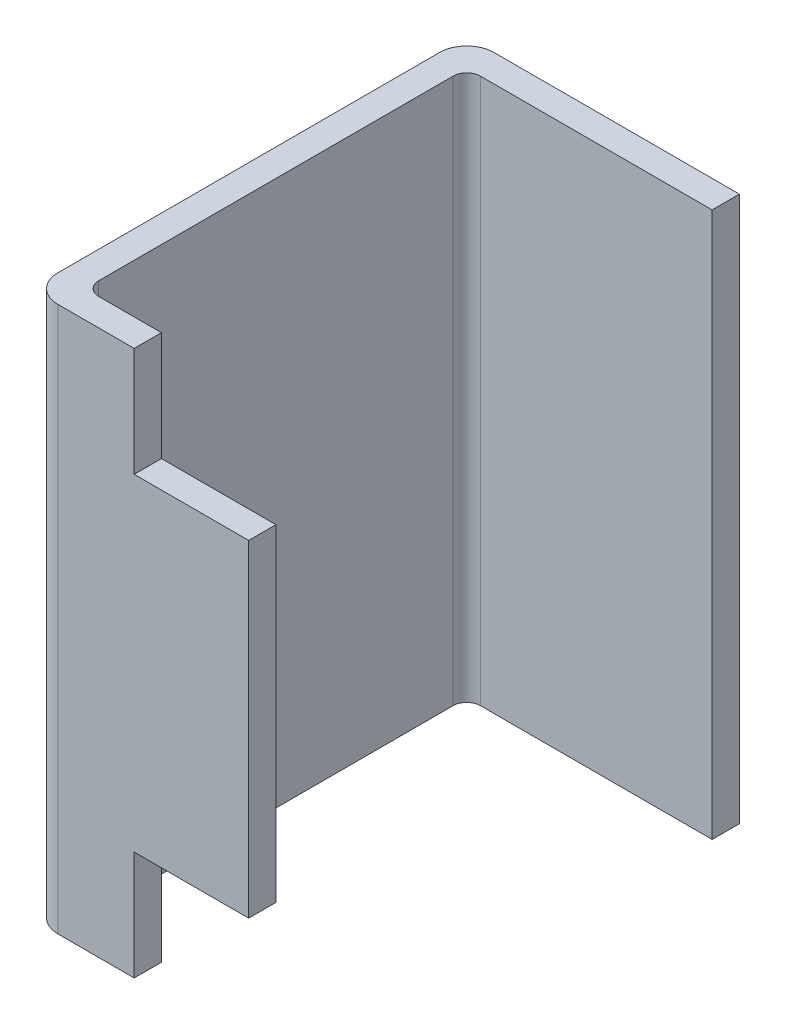
ISO-10303-21;
HEADER;
FILE_DESCRIPTION(('STEP AP214'),'2;1');
FILE_NAME('part.step','',(''),(''),'','','');
FILE_SCHEMA(('AUTOMOTIVE_DESIGN { 1 0 10303 214 1 1 1 1 }'));
ENDSEC;
DATA;
#1=APPLICATION_CONTEXT('core data for automotive mechanical design processes');
#2=APPLICATION_PROTOCOL_DEFINITION('international standard','automotive_design',2000,#1);
#3=PRODUCT_CONTEXT('',#1,'mechanical');
#4=PRODUCT('Part','Part','',(#3));
#5=PRODUCT_RELATED_PRODUCT_CATEGORY('part','',(#4));
#6=PRODUCT_DEFINITION_FORMATION('','',#4);
#7=PRODUCT_DEFINITION_CONTEXT('part definition',#1,'design');
#8=PRODUCT_DEFINITION('design','',#6,#7);
#9=PRODUCT_DEFINITION_SHAPE('','',#8);
#10=(LENGTH_UNIT() NAMED_UNIT(*) SI_UNIT(.MILLI.,.METRE.));
#11=(NAMED_UNIT(*) PLANE_ANGLE_UNIT() SI_UNIT($,.RADIAN.));
#12=(NAMED_UNIT(*) SI_UNIT($,.STERADIAN.) SOLID_ANGLE_UNIT());
#13=UNCERTAINTY_MEASURE_WITH_UNIT(LENGTH_MEASURE(1.E-05),#10,'distance_accuracy_value','');
#14=(GEOMETRIC_REPRESENTATION_CONTEXT(3) GLOBAL_UNCERTAINTY_ASSIGNED_CONTEXT((#13)) GLOBAL_UNIT_ASSIGNED_CONTEXT((#10,
#11,#12)) REPRESENTATION_CONTEXT('',''));
#15=CARTESIAN_POINT('',(0.,0.,0.));
#16=DIRECTION('',(0.,0.,1.));
#17=DIRECTION('',(1.,0.,0.));
#18=AXIS2_PLACEMENT_3D('',#15,#16,#17);
#19=CARTESIAN_POINT('',(0.404981821047639,-0.15,0.4));
#20=DIRECTION('',(0.,-1.,0.));
#21=DIRECTION('',(-1.,0.,0.));
#22=AXIS2_PLACEMENT_3D('',#19,#20,#21);
#23=PLANE('',#22);
#24=DIRECTION('',(0.,0.,-1.));
#25=VECTOR('',#24,1.);
#26=CARTESIAN_POINT('',(-0.3,-0.15,0.4));
#27=LINE('',#26,#25);
#28=CARTESIAN_POINT('',(-0.3,-0.15,0.4));
#29=VERTEX_POINT('',#28);
#30=CARTESIAN_POINT('',(-0.3,-0.15,0.375000000029104));
#31=VERTEX_POINT('',#30);
#32=EDGE_CURVE('E11',#29,#31,#27,.T.);
#33=ORIENTED_EDGE('',*,*,#32,.F.);
#34=DIRECTION('',(1.,0.,0.));
#35=VECTOR('',#34,1.);
#36=CARTESIAN_POINT('',(-0.0350090894761804,-0.15,0.4));
#37=LINE('',#36,#35);
#38=CARTESIAN_POINT('',(-0.404981821047639,-0.15,0.4));
#39=VERTEX_POINT('',#38);
#40=EDGE_CURVE('E24',#39,#29,#37,.T.);
#41=ORIENTED_EDGE('',*,*,#40,.F.);
#42=DIRECTION('',(0.,0.,-1.));
#43=VECTOR('',#42,1.);
#44=CARTESIAN_POINT('',(-0.404981821047639,-0.15,0.4));
#45=LINE('',#44,#43);
#46=CARTESIAN_POINT('',(-0.404981821047639,-0.15,0.375));
#47=VERTEX_POINT('',#46);
#48=EDGE_CURVE('E255',#39,#47,#45,.T.);
#49=ORIENTED_EDGE('',*,*,#48,.T.);
#50=DIRECTION('',(-1.,0.,0.));
#51=VECTOR('',#50,1.);
#52=CARTESIAN_POINT('',(0.0524909105238196,-0.15,0.375000000029103));
#53=LINE('',#52,#51);
#54=EDGE_CURVE('E252',#31,#47,#53,.T.);
#55=ORIENTED_EDGE('',*,*,#54,.F.);
#56=EDGE_LOOP('',(#33,#41,#49,#55));
#57=FACE_BOUND('',#56,.T.);
#58=ADVANCED_FACE('F17',(#57),#23,.T.);
#59=CARTESIAN_POINT('',(-0.404981821047639,-0.15,0.4));
#60=DIRECTION('',(1.,0.,0.));
#61=DIRECTION('',(0.,-1.,0.));
#62=AXIS2_PLACEMENT_3D('',#59,#60,#61);
#63=PLANE('',#62);
#64=DIRECTION('',(0.,0.,1.));
#65=VECTOR('',#64,1.);
#66=CARTESIAN_POINT('',(-0.404981821047639,-0.25,0.3));
#67=LINE('',#66,#65);
#68=CARTESIAN_POINT('',(-0.404981821047639,-0.25,0.375000000029104));
#69=VERTEX_POINT('',#68);
#70=CARTESIAN_POINT('',(-0.404981821047639,-0.25,0.4));
#71=VERTEX_POINT('',#70);
#72=EDGE_CURVE('E250',#69,#71,#67,.T.);
#73=ORIENTED_EDGE('',*,*,#72,.F.);
#74=DIRECTION('',(0.,-1.,0.));
#75=VECTOR('',#74,1.);
#76=CARTESIAN_POINT('',(-0.404981821047639,-0.075,0.375000000029104));
#77=LINE('',#76,#75);
#78=EDGE_CURVE('E247',#47,#69,#77,.T.);
#79=ORIENTED_EDGE('',*,*,#78,.F.);
#80=ORIENTED_EDGE('',*,*,#48,.F.);
#81=DIRECTION('',(0.,1.,0.));
#82=VECTOR('',#81,1.);
#83=CARTESIAN_POINT('',(-0.404981821047639,-0.075,0.4));
#84=LINE('',#83,#82);
#85=EDGE_CURVE('E244',#71,#39,#84,.T.);
#86=ORIENTED_EDGE('',*,*,#85,.F.);
#87=EDGE_LOOP('',(#73,#79,#80,#86));
#88=FACE_BOUND('',#87,.T.);
#89=ADVANCED_FACE('F275',(#88),#63,.T.);
#90=CARTESIAN_POINT('',(-0.3,0.,0.4));
#91=DIRECTION('',(1.,0.,0.));
#92=DIRECTION('',(0.,0.,-1.));
#93=AXIS2_PLACEMENT_3D('',#90,#91,#92);
#94=PLANE('',#93);
#95=ORIENTED_EDGE('',*,*,#32,.T.);
#96=DIRECTION('',(0.,1.,0.));
#97=VECTOR('',#96,1.);
#98=CARTESIAN_POINT('',(-0.3,0.,0.375000000029104));
#99=LINE('',#98,#97);
#100=CARTESIAN_POINT('',(-0.3,0.15,0.375000000029104));
#101=VERTEX_POINT('',#100);
#102=EDGE_CURVE('E242',#31,#101,#99,.T.);
#103=ORIENTED_EDGE('',*,*,#102,.T.);
#104=DIRECTION('',(0.,0.,1.));
#105=VECTOR('',#104,1.);
#106=CARTESIAN_POINT('',(-0.3,0.15,0.4));
#107=LINE('',#106,#105);
#108=CARTESIAN_POINT('',(-0.3,0.15,0.4));
#109=VERTEX_POINT('',#108);
#110=EDGE_CURVE('E240',#101,#109,#107,.T.);
#111=ORIENTED_EDGE('',*,*,#110,.T.);
#112=DIRECTION('',(0.,1.,0.));
#113=VECTOR('',#112,1.);
#114=CARTESIAN_POINT('',(-0.3,0.,0.4));
#115=LINE('',#114,#113);
#116=EDGE_CURVE('E131',#29,#109,#115,.T.);
#117=ORIENTED_EDGE('',*,*,#116,.F.);
#118=EDGE_LOOP('',(#95,#103,#111,#117));
#119=FACE_BOUND('',#118,.T.);
#120=ADVANCED_FACE('F259',(#119),#94,.T.);
#121=CARTESIAN_POINT('',(-0.3,0.,0.375000000029104));
#122=DIRECTION('',(0.,0.,-1.));
#123=DIRECTION('',(-1.,0.,0.));
#124=AXIS2_PLACEMENT_3D('',#121,#122,#123);
#125=PLANE('',#124);
#126=ORIENTED_EDGE('',*,*,#54,.T.);
#127=ORIENTED_EDGE('',*,*,#78,.T.);
#128=DIRECTION('',(1.,0.,0.));
#129=VECTOR('',#128,1.);
#130=CARTESIAN_POINT('',(-0.3,-0.25,0.375000000029104));
#131=LINE('',#130,#129);
#132=CARTESIAN_POINT('',(-0.46250000000291,-0.25,0.375000000029104));
#133=VERTEX_POINT('',#132);
#134=EDGE_CURVE('E236',#133,#69,#131,.T.);
#135=ORIENTED_EDGE('',*,*,#134,.F.);
#136=DIRECTION('',(0.,1.,0.));
#137=VECTOR('',#136,1.);
#138=CARTESIAN_POINT('',(-0.46250000000291,0.,0.375000000029104));
#139=LINE('',#138,#137);
#140=CARTESIAN_POINT('',(-0.46250000000291,0.25,0.375000000029104));
#141=VERTEX_POINT('',#140);
#142=EDGE_CURVE('E234',#133,#141,#139,.T.);
#143=ORIENTED_EDGE('',*,*,#142,.T.);
#144=DIRECTION('',(-1.,0.,0.));
#145=VECTOR('',#144,1.);
#146=CARTESIAN_POINT('',(-0.3,0.25,0.375000000029104));
#147=LINE('',#146,#145);
#148=CARTESIAN_POINT('',(-0.404981821047639,0.25,0.375000000029104));
#149=VERTEX_POINT('',#148);
#150=EDGE_CURVE('E231',#149,#141,#147,.T.);
#151=ORIENTED_EDGE('',*,*,#150,.F.);
#152=DIRECTION('',(0.,-1.,0.));
#153=VECTOR('',#152,1.);
#154=CARTESIAN_POINT('',(-0.404981821047639,0.075,0.375000000029104));
#155=LINE('',#154,#153);
#156=CARTESIAN_POINT('',(-0.404981821047639,0.15,0.375));
#157=VERTEX_POINT('',#156);
#158=EDGE_CURVE('E229',#149,#157,#155,.T.);
#159=ORIENTED_EDGE('',*,*,#158,.T.);
#160=DIRECTION('',(1.,0.,0.));
#161=VECTOR('',#160,1.);
#162=CARTESIAN_POINT('',(0.0524909105238196,0.15,0.375000000029103));
#163=LINE('',#162,#161);
#164=EDGE_CURVE('E149',#157,#101,#163,.T.);
#165=ORIENTED_EDGE('',*,*,#164,.T.);
#166=ORIENTED_EDGE('',*,*,#102,.F.);
#167=EDGE_LOOP('',(#126,#127,#135,#143,#151,#159,#165,#166));
#168=FACE_BOUND('',#167,.T.);
#169=ADVANCED_FACE('F262',(#168),#125,.T.);
#170=CARTESIAN_POINT('',(-0.375,0.25,0.2));
#171=DIRECTION('',(0.,1.,0.));
#172=DIRECTION('',(0.,0.,1.));
#173=AXIS2_PLACEMENT_3D('',#170,#171,#172);
#174=PLANE('',#173);
#175=DIRECTION('',(0.,0.,-1.));
#176=VECTOR('',#175,1.);
#177=CARTESIAN_POINT('',(-0.404981821047639,0.25,0.3));
#178=LINE('',#177,#176);
#179=CARTESIAN_POINT('',(-0.404981821047639,0.25,0.4));
#180=VERTEX_POINT('',#179);
#181=EDGE_CURVE('E143',#180,#149,#178,.T.);
#182=ORIENTED_EDGE('',*,*,#181,.T.);
#183=ORIENTED_EDGE('',*,*,#150,.T.);
#184=CARTESIAN_POINT('',(-0.46250000000291,0.25,0.362500000029104));
#185=DIRECTION('',(0.,-1.,0.));
#186=DIRECTION('',(1.,0.,0.));
#187=AXIS2_PLACEMENT_3D('',#184,#185,#186);
#188=CIRCLE('',#187,0.0125);
#189=CARTESIAN_POINT('',(-0.47500000000291,0.25,0.362500000029104));
#190=VERTEX_POINT('',#189);
#191=EDGE_CURVE('E225',#141,#190,#188,.T.);
#192=ORIENTED_EDGE('',*,*,#191,.T.);
#193=DIRECTION('',(0.,0.,-1.));
#194=VECTOR('',#193,1.);
#195=CARTESIAN_POINT('',(-0.47500000000291,0.25,0.362500000029104));
#196=LINE('',#195,#194);
#197=CARTESIAN_POINT('',(-0.475000000002911,0.25,0.0375000000116415));
#198=VERTEX_POINT('',#197);
#199=EDGE_CURVE('E223',#190,#198,#196,.T.);
#200=ORIENTED_EDGE('',*,*,#199,.T.);
#201=CARTESIAN_POINT('',(-0.46250000000291,0.25,0.0375000000116415));
#202=DIRECTION('',(0.,-1.,0.));
#203=DIRECTION('',(0.,0.,1.));
#204=AXIS2_PLACEMENT_3D('',#201,#202,#203);
#205=CIRCLE('',#204,0.0125);
#206=CARTESIAN_POINT('',(-0.46250000000291,0.25,0.0250000000116415));
#207=VERTEX_POINT('',#206);
#208=EDGE_CURVE('E221',#198,#207,#205,.T.);
#209=ORIENTED_EDGE('',*,*,#208,.T.);
#210=DIRECTION('',(1.,0.,0.));
#211=VECTOR('',#210,1.);
#212=CARTESIAN_POINT('',(-0.46250000000291,0.25,0.0250000000116415));
#213=LINE('',#212,#211);
#214=CARTESIAN_POINT('',(-0.25,0.25,0.0250000000116414));
#215=VERTEX_POINT('',#214);
#216=EDGE_CURVE('E219',#207,#215,#213,.T.);
#217=ORIENTED_EDGE('',*,*,#216,.T.);
#218=DIRECTION('',(0.,0.,-1.));
#219=VECTOR('',#218,1.);
#220=CARTESIAN_POINT('',(-0.25,0.25,0.0250000000116414));
#221=LINE('',#220,#219);
#222=CARTESIAN_POINT('',(-0.25,0.25,0.));
#223=VERTEX_POINT('',#222);
#224=EDGE_CURVE('E217',#215,#223,#221,.T.);
#225=ORIENTED_EDGE('',*,*,#224,.T.);
#226=DIRECTION('',(-1.,0.,0.));
#227=VECTOR('',#226,1.);
#228=CARTESIAN_POINT('',(-0.25,0.25,0.));
#229=LINE('',#228,#227);
#230=CARTESIAN_POINT('',(-0.475,0.25,0.));
#231=VERTEX_POINT('',#230);
#232=EDGE_CURVE('E215',#223,#231,#229,.T.);
#233=ORIENTED_EDGE('',*,*,#232,.T.);
#234=CARTESIAN_POINT('',(-0.475,0.25,0.0249999999999999));
#235=DIRECTION('',(0.,1.,0.));
#236=DIRECTION('',(0.,0.,-1.));
#237=AXIS2_PLACEMENT_3D('',#234,#235,#236);
#238=CIRCLE('',#237,0.0250000000000001);
#239=CARTESIAN_POINT('',(-0.5,0.25,0.025));
#240=VERTEX_POINT('',#239);
#241=EDGE_CURVE('E213',#231,#240,#238,.T.);
#242=ORIENTED_EDGE('',*,*,#241,.T.);
#243=DIRECTION('',(0.,0.,1.));
#244=VECTOR('',#243,1.);
#245=CARTESIAN_POINT('',(-0.5,0.25,0.025));
#246=LINE('',#245,#244);
#247=CARTESIAN_POINT('',(-0.5,0.25,0.375));
#248=VERTEX_POINT('',#247);
#249=EDGE_CURVE('E211',#240,#248,#246,.T.);
#250=ORIENTED_EDGE('',*,*,#249,.T.);
#251=CARTESIAN_POINT('',(-0.475,0.25,0.375));
#252=DIRECTION('',(0.,1.,0.));
#253=DIRECTION('',(-1.,0.,0.));
#254=AXIS2_PLACEMENT_3D('',#251,#252,#253);
#255=CIRCLE('',#254,0.0250000000000002);
#256=CARTESIAN_POINT('',(-0.475,0.25,0.4));
#257=VERTEX_POINT('',#256);
#258=EDGE_CURVE('E209',#248,#257,#255,.T.);
#259=ORIENTED_EDGE('',*,*,#258,.T.);
#260=DIRECTION('',(1.,0.,0.));
#261=VECTOR('',#260,1.);
#262=CARTESIAN_POINT('',(-0.475,0.25,0.4));
#263=LINE('',#262,#261);
#264=EDGE_CURVE('E207',#257,#180,#263,.T.);
#265=ORIENTED_EDGE('',*,*,#264,.T.);
#266=EDGE_LOOP('',(#182,#183,#192,#200,#209,#217,#225,#233,#242,#250,#259,#265));
#267=FACE_BOUND('',#266,.T.);
#268=ADVANCED_FACE('F264',(#267),#174,.T.);
#269=CARTESIAN_POINT('',(-0.25,0.,0.));
#270=DIRECTION('',(0.,0.,-1.));
#271=DIRECTION('',(-1.,0.,0.));
#272=AXIS2_PLACEMENT_3D('',#269,#270,#271);
#273=PLANE('',#272);
#274=DIRECTION('',(0.,1.,0.));
#275=VECTOR('',#274,1.);
#276=CARTESIAN_POINT('',(-0.475,0.,0.));
#277=LINE('',#276,#275);
#278=CARTESIAN_POINT('',(-0.475,-0.25,0.));
#279=VERTEX_POINT('',#278);
#280=EDGE_CURVE('E204',#279,#231,#277,.T.);
#281=ORIENTED_EDGE('',*,*,#280,.T.);
#282=ORIENTED_EDGE('',*,*,#232,.F.);
#283=DIRECTION('',(0.,-1.,0.));
#284=VECTOR('',#283,1.);
#285=CARTESIAN_POINT('',(-0.25,0.,0.));
#286=LINE('',#285,#284);
#287=CARTESIAN_POINT('',(-0.25,-0.25,0.));
#288=VERTEX_POINT('',#287);
#289=EDGE_CURVE('E202',#223,#288,#286,.T.);
#290=ORIENTED_EDGE('',*,*,#289,.T.);
#291=DIRECTION('',(1.,0.,0.));
#292=VECTOR('',#291,1.);
#293=CARTESIAN_POINT('',(-0.25,-0.25,0.));
#294=LINE('',#293,#292);
#295=EDGE_CURVE('E199',#279,#288,#294,.T.);
#296=ORIENTED_EDGE('',*,*,#295,.F.);
#297=EDGE_LOOP('',(#281,#282,#290,#296));
#298=FACE_BOUND('',#297,.T.);
#299=ADVANCED_FACE('F301',(#298),#273,.T.);
#300=CARTESIAN_POINT('',(-0.475,0.,0.0249999999999999));
#301=DIRECTION('',(0.,1.,0.));
#302=DIRECTION('',(0.,0.,-1.));
#303=AXIS2_PLACEMENT_3D('',#300,#301,#302);
#304=CYLINDRICAL_SURFACE('',#303,0.0250000000000001);
#305=DIRECTION('',(0.,1.,0.));
#306=VECTOR('',#305,1.);
#307=CARTESIAN_POINT('',(-0.5,0.,0.025));
#308=LINE('',#307,#306);
#309=CARTESIAN_POINT('',(-0.5,-0.25,0.025));
#310=VERTEX_POINT('',#309);
#311=EDGE_CURVE('E196',#310,#240,#308,.T.);
#312=ORIENTED_EDGE('',*,*,#311,.T.);
#313=ORIENTED_EDGE('',*,*,#241,.F.);
#314=ORIENTED_EDGE('',*,*,#280,.F.);
#315=CARTESIAN_POINT('',(-0.475,-0.25,0.0249999999999999));
#316=DIRECTION('',(0.,-1.,0.));
#317=DIRECTION('',(0.,0.,-1.));
#318=AXIS2_PLACEMENT_3D('',#315,#316,#317);
#319=CIRCLE('',#318,0.0250000000000001);
#320=EDGE_CURVE('E193',#310,#279,#319,.T.);
#321=ORIENTED_EDGE('',*,*,#320,.F.);
#322=EDGE_LOOP('',(#312,#313,#314,#321));
#323=FACE_BOUND('',#322,.T.);
#324=ADVANCED_FACE('F304',(#323),#304,.T.);
#325=CARTESIAN_POINT('',(-0.5,0.,0.025));
#326=DIRECTION('',(-1.,0.,0.));
#327=DIRECTION('',(0.,0.,1.));
#328=AXIS2_PLACEMENT_3D('',#325,#326,#327);
#329=PLANE('',#328);
#330=DIRECTION('',(0.,1.,0.));
#331=VECTOR('',#330,1.);
#332=CARTESIAN_POINT('',(-0.5,0.,0.375));
#333=LINE('',#332,#331);
#334=CARTESIAN_POINT('',(-0.5,-0.25,0.375));
#335=VERTEX_POINT('',#334);
#336=EDGE_CURVE('E190',#335,#248,#333,.T.);
#337=ORIENTED_EDGE('',*,*,#336,.T.);
#338=ORIENTED_EDGE('',*,*,#249,.F.);
#339=ORIENTED_EDGE('',*,*,#311,.F.);
#340=DIRECTION('',(0.,0.,-1.));
#341=VECTOR('',#340,1.);
#342=CARTESIAN_POINT('',(-0.5,-0.25,0.025));
#343=LINE('',#342,#341);
#344=EDGE_CURVE('E187',#335,#310,#343,.T.);
#345=ORIENTED_EDGE('',*,*,#344,.F.);
#346=EDGE_LOOP('',(#337,#338,#339,#345));
#347=FACE_BOUND('',#346,.T.);
#348=ADVANCED_FACE('F307',(#347),#329,.T.);
#349=CARTESIAN_POINT('',(-0.475,0.,0.375));
#350=DIRECTION('',(0.,1.,0.));
#351=DIRECTION('',(-1.,0.,0.));
#352=AXIS2_PLACEMENT_3D('',#349,#350,#351);
#353=CYLINDRICAL_SURFACE('',#352,0.0250000000000002);
#354=DIRECTION('',(0.,1.,0.));
#355=VECTOR('',#354,1.);
#356=CARTESIAN_POINT('',(-0.475,0.,0.4));
#357=LINE('',#356,#355);
#358=CARTESIAN_POINT('',(-0.475,-0.25,0.4));
#359=VERTEX_POINT('',#358);
#360=EDGE_CURVE('E184',#359,#257,#357,.T.);
#361=ORIENTED_EDGE('',*,*,#360,.T.);
#362=ORIENTED_EDGE('',*,*,#258,.F.);
#363=ORIENTED_EDGE('',*,*,#336,.F.);
#364=CARTESIAN_POINT('',(-0.475,-0.25,0.375));
#365=DIRECTION('',(0.,-1.,0.));
#366=DIRECTION('',(-1.,0.,0.));
#367=AXIS2_PLACEMENT_3D('',#364,#365,#366);
#368=CIRCLE('',#367,0.0250000000000002);
#369=EDGE_CURVE('E181',#359,#335,#368,.T.);
#370=ORIENTED_EDGE('',*,*,#369,.F.);
#371=EDGE_LOOP('',(#361,#362,#363,#370));
#372=FACE_BOUND('',#371,.T.);
#373=ADVANCED_FACE('F269',(#372),#353,.T.);
#374=CARTESIAN_POINT('',(-0.46250000000291,0.,0.362500000029104));
#375=DIRECTION('',(0.,1.,0.));
#376=DIRECTION('',(1.,0.,0.));
#377=AXIS2_PLACEMENT_3D('',#374,#375,#376);
#378=CYLINDRICAL_SURFACE('',#377,0.0125);
#379=DIRECTION('',(0.,1.,0.));
#380=VECTOR('',#379,1.);
#381=CARTESIAN_POINT('',(-0.47500000000291,0.,0.362500000029104));
#382=LINE('',#381,#380);
#383=CARTESIAN_POINT('',(-0.47500000000291,-0.25,0.362500000029104));
#384=VERTEX_POINT('',#383);
#385=EDGE_CURVE('E178',#384,#190,#382,.T.);
#386=ORIENTED_EDGE('',*,*,#385,.T.);
#387=ORIENTED_EDGE('',*,*,#191,.F.);
#388=ORIENTED_EDGE('',*,*,#142,.F.);
#389=CARTESIAN_POINT('',(-0.46250000000291,-0.25,0.362500000029104));
#390=DIRECTION('',(0.,1.,0.));
#391=DIRECTION('',(1.,0.,0.));
#392=AXIS2_PLACEMENT_3D('',#389,#390,#391);
#393=CIRCLE('',#392,0.0125);
#394=EDGE_CURVE('E175',#384,#133,#393,.T.);
#395=ORIENTED_EDGE('',*,*,#394,.F.);
#396=EDGE_LOOP('',(#386,#387,#388,#395));
#397=FACE_BOUND('',#396,.T.);
#398=ADVANCED_FACE('F278',(#397),#378,.F.);
#399=CARTESIAN_POINT('',(-0.47500000000291,0.,0.362500000029104));
#400=DIRECTION('',(1.,0.,0.));
#401=DIRECTION('',(0.,0.,-1.));
#402=AXIS2_PLACEMENT_3D('',#399,#400,#401);
#403=PLANE('',#402);
#404=DIRECTION('',(0.,1.,0.));
#405=VECTOR('',#404,1.);
#406=CARTESIAN_POINT('',(-0.475000000002911,0.,0.0375000000116415));
#407=LINE('',#406,#405);
#408=CARTESIAN_POINT('',(-0.475000000002911,-0.25,0.0375000000116415));
#409=VERTEX_POINT('',#408);
#410=EDGE_CURVE('E172',#409,#198,#407,.T.);
#411=ORIENTED_EDGE('',*,*,#410,.T.);
#412=ORIENTED_EDGE('',*,*,#199,.F.);
#413=ORIENTED_EDGE('',*,*,#385,.F.);
#414=DIRECTION('',(0.,0.,1.));
#415=VECTOR('',#414,1.);
#416=CARTESIAN_POINT('',(-0.47500000000291,-0.25,0.362500000029104));
#417=LINE('',#416,#415);
#418=EDGE_CURVE('E169',#409,#384,#417,.T.);
#419=ORIENTED_EDGE('',*,*,#418,.F.);
#420=EDGE_LOOP('',(#411,#412,#413,#419));
#421=FACE_BOUND('',#420,.T.);
#422=ADVANCED_FACE('F282',(#421),#403,.T.);
#423=CARTESIAN_POINT('',(-0.46250000000291,0.,0.0375000000116415));
#424=DIRECTION('',(0.,1.,0.));
#425=DIRECTION('',(0.,0.,1.));
#426=AXIS2_PLACEMENT_3D('',#423,#424,#425);
#427=CYLINDRICAL_SURFACE('',#426,0.0125);
#428=DIRECTION('',(0.,1.,0.));
#429=VECTOR('',#428,1.);
#430=CARTESIAN_POINT('',(-0.46250000000291,0.,0.0250000000116415));
#431=LINE('',#430,#429);
#432=CARTESIAN_POINT('',(-0.46250000000291,-0.25,0.0250000000116415));
#433=VERTEX_POINT('',#432);
#434=EDGE_CURVE('E166',#433,#207,#431,.T.);
#435=ORIENTED_EDGE('',*,*,#434,.T.);
#436=ORIENTED_EDGE('',*,*,#208,.F.);
#437=ORIENTED_EDGE('',*,*,#410,.F.);
#438=CARTESIAN_POINT('',(-0.46250000000291,-0.25,0.0375000000116415));
#439=DIRECTION('',(0.,1.,0.));
#440=DIRECTION('',(0.,0.,1.));
#441=AXIS2_PLACEMENT_3D('',#438,#439,#440);
#442=CIRCLE('',#441,0.0125);
#443=EDGE_CURVE('E163',#433,#409,#442,.T.);
#444=ORIENTED_EDGE('',*,*,#443,.F.);
#445=EDGE_LOOP('',(#435,#436,#437,#444));
#446=FACE_BOUND('',#445,.T.);
#447=ADVANCED_FACE('F287',(#446),#427,.F.);
#448=CARTESIAN_POINT('',(-0.46250000000291,0.,0.0250000000116415));
#449=DIRECTION('',(0.,0.,1.));
#450=DIRECTION('',(1.,0.,0.));
#451=AXIS2_PLACEMENT_3D('',#448,#449,#450);
#452=PLANE('',#451);
#453=DIRECTION('',(0.,1.,0.));
#454=VECTOR('',#453,1.);
#455=CARTESIAN_POINT('',(-0.25,0.,0.0250000000116414));
#456=LINE('',#455,#454);
#457=CARTESIAN_POINT('',(-0.25,-0.25,0.0250000000116414));
#458=VERTEX_POINT('',#457);
#459=EDGE_CURVE('E160',#458,#215,#456,.T.);
#460=ORIENTED_EDGE('',*,*,#459,.T.);
#461=ORIENTED_EDGE('',*,*,#216,.F.);
#462=ORIENTED_EDGE('',*,*,#434,.F.);
#463=DIRECTION('',(-1.,0.,0.));
#464=VECTOR('',#463,1.);
#465=CARTESIAN_POINT('',(-0.46250000000291,-0.25,0.0250000000116415));
#466=LINE('',#465,#464);
#467=EDGE_CURVE('E157',#458,#433,#466,.T.);
#468=ORIENTED_EDGE('',*,*,#467,.F.);
#469=EDGE_LOOP('',(#460,#461,#462,#468));
#470=FACE_BOUND('',#469,.T.);
#471=ADVANCED_FACE('F291',(#470),#452,.T.);
#472=CARTESIAN_POINT('',(-0.25,0.,0.0250000000116414));
#473=DIRECTION('',(1.,0.,0.));
#474=DIRECTION('',(0.,0.,-1.));
#475=AXIS2_PLACEMENT_3D('',#472,#473,#474);
#476=PLANE('',#475);
#477=ORIENTED_EDGE('',*,*,#289,.F.);
#478=ORIENTED_EDGE('',*,*,#224,.F.);
#479=ORIENTED_EDGE('',*,*,#459,.F.);
#480=DIRECTION('',(0.,0.,1.));
#481=VECTOR('',#480,1.);
#482=CARTESIAN_POINT('',(-0.25,-0.25,0.0250000000116414));
#483=LINE('',#482,#481);
#484=EDGE_CURVE('E154',#288,#458,#483,.T.);
#485=ORIENTED_EDGE('',*,*,#484,.F.);
#486=EDGE_LOOP('',(#477,#478,#479,#485));
#487=FACE_BOUND('',#486,.T.);
#488=ADVANCED_FACE('F296',(#487),#476,.T.);
#489=CARTESIAN_POINT('',(-0.375,-0.25,0.2));
#490=DIRECTION('',(0.,1.,0.));
#491=DIRECTION('',(0.,0.,1.));
#492=AXIS2_PLACEMENT_3D('',#489,#490,#491);
#493=PLANE('',#492);
#494=ORIENTED_EDGE('',*,*,#72,.T.);
#495=DIRECTION('',(-1.,0.,0.));
#496=VECTOR('',#495,1.);
#497=CARTESIAN_POINT('',(-0.475,-0.25,0.4));
#498=LINE('',#497,#496);
#499=EDGE_CURVE('E135',#71,#359,#498,.T.);
#500=ORIENTED_EDGE('',*,*,#499,.T.);
#501=ORIENTED_EDGE('',*,*,#369,.T.);
#502=ORIENTED_EDGE('',*,*,#344,.T.);
#503=ORIENTED_EDGE('',*,*,#320,.T.);
#504=ORIENTED_EDGE('',*,*,#295,.T.);
#505=ORIENTED_EDGE('',*,*,#484,.T.);
#506=ORIENTED_EDGE('',*,*,#467,.T.);
#507=ORIENTED_EDGE('',*,*,#443,.T.);
#508=ORIENTED_EDGE('',*,*,#418,.T.);
#509=ORIENTED_EDGE('',*,*,#394,.T.);
#510=ORIENTED_EDGE('',*,*,#134,.T.);
#511=EDGE_LOOP('',(#494,#500,#501,#502,#503,#504,#505,#506,#507,#508,#509,#510));
#512=FACE_BOUND('',#511,.T.);
#513=ADVANCED_FACE('F272',(#512),#493,.F.);
#514=CARTESIAN_POINT('',(-0.475,0.,0.4));
#515=DIRECTION('',(0.,0.,1.));
#516=DIRECTION('',(1.,0.,0.));
#517=AXIS2_PLACEMENT_3D('',#514,#515,#516);
#518=PLANE('',#517);
#519=ORIENTED_EDGE('',*,*,#40,.T.);
#520=ORIENTED_EDGE('',*,*,#116,.T.);
#521=DIRECTION('',(-1.,0.,0.));
#522=VECTOR('',#521,1.);
#523=CARTESIAN_POINT('',(-0.0350090894761804,0.15,0.4));
#524=LINE('',#523,#522);
#525=CARTESIAN_POINT('',(-0.404981821047639,0.15,0.4));
#526=VERTEX_POINT('',#525);
#527=EDGE_CURVE('E126',#109,#526,#524,.T.);
#528=ORIENTED_EDGE('',*,*,#527,.T.);
#529=DIRECTION('',(0.,1.,0.));
#530=VECTOR('',#529,1.);
#531=CARTESIAN_POINT('',(-0.404981821047639,0.075,0.4));
#532=LINE('',#531,#530);
#533=EDGE_CURVE('E130',#526,#180,#532,.T.);
#534=ORIENTED_EDGE('',*,*,#533,.T.);
#535=ORIENTED_EDGE('',*,*,#264,.F.);
#536=ORIENTED_EDGE('',*,*,#360,.F.);
#537=ORIENTED_EDGE('',*,*,#499,.F.);
#538=ORIENTED_EDGE('',*,*,#85,.T.);
#539=EDGE_LOOP('',(#519,#520,#528,#534,#535,#536,#537,#538));
#540=FACE_BOUND('',#539,.T.);
#541=ADVANCED_FACE('F128',(#540),#518,.T.);
#542=CARTESIAN_POINT('',(-0.404981821047639,0.15,0.4));
#543=DIRECTION('',(-1.,0.,0.));
#544=DIRECTION('',(0.,1.,0.));
#545=AXIS2_PLACEMENT_3D('',#542,#543,#544);
#546=PLANE('',#545);
#547=ORIENTED_EDGE('',*,*,#181,.F.);
#548=ORIENTED_EDGE('',*,*,#533,.F.);
#549=DIRECTION('',(0.,0.,-1.));
#550=VECTOR('',#549,1.);
#551=CARTESIAN_POINT('',(-0.404981821047639,0.15,0.4));
#552=LINE('',#551,#550);
#553=EDGE_CURVE('E141',#526,#157,#552,.T.);
#554=ORIENTED_EDGE('',*,*,#553,.T.);
#555=ORIENTED_EDGE('',*,*,#158,.F.);
#556=EDGE_LOOP('',(#547,#548,#554,#555));
#557=FACE_BOUND('',#556,.T.);
#558=ADVANCED_FACE('F139',(#557),#546,.F.);
#559=CARTESIAN_POINT('',(0.404981821047639,0.15,0.4));
#560=DIRECTION('',(0.,-1.,0.));
#561=DIRECTION('',(-1.,0.,0.));
#562=AXIS2_PLACEMENT_3D('',#559,#560,#561);
#563=PLANE('',#562);
#564=ORIENTED_EDGE('',*,*,#110,.F.);
#565=ORIENTED_EDGE('',*,*,#164,.F.);
#566=ORIENTED_EDGE('',*,*,#553,.F.);
#567=ORIENTED_EDGE('',*,*,#527,.F.);
#568=EDGE_LOOP('',(#564,#565,#566,#567));
#569=FACE_BOUND('',#568,.T.);
#570=ADVANCED_FACE('F147',(#569),#563,.F.);
#571=CLOSED_SHELL('',(#58,#89,#120,#169,#268,#299,#324,#348,#373,#398,#422,#447,#471,#488,#513,
#541,#558,#570));
#572=MANIFOLD_SOLID_BREP('B1',#571);
#573=ADVANCED_BREP_SHAPE_REPRESENTATION('',(#18,#572),#14);
#574=SHAPE_DEFINITION_REPRESENTATION(#9,#573);
ENDSEC;
END-ISO-10303-21;
